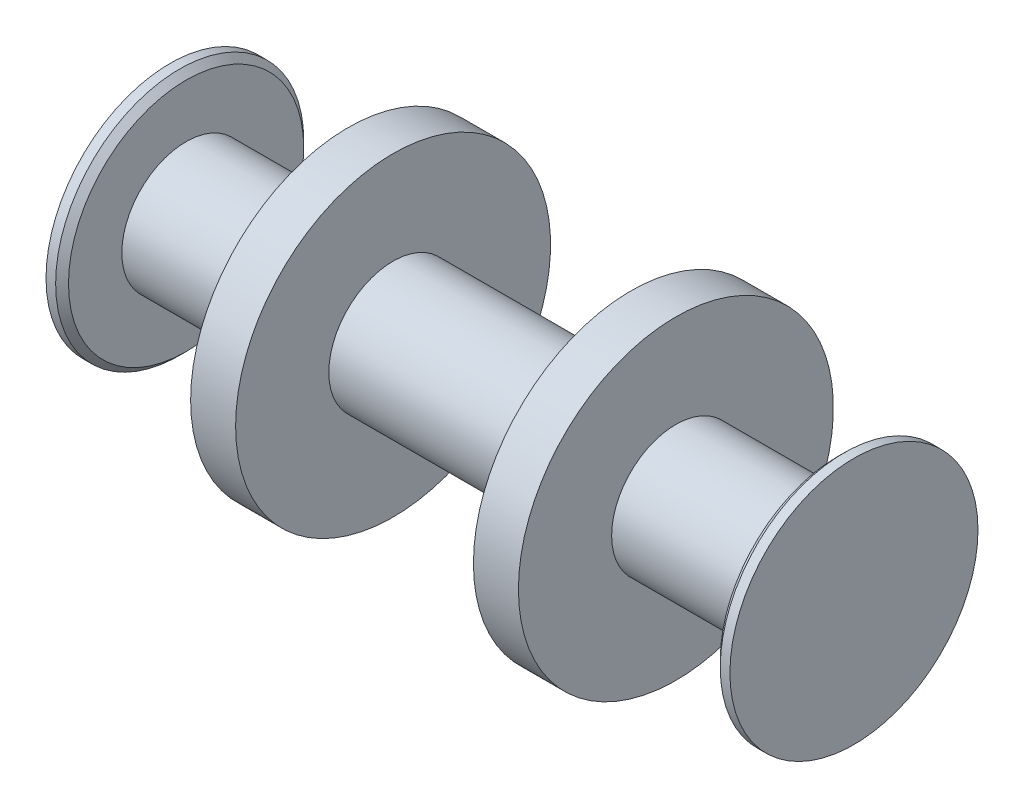
ISO-10303-21;
HEADER;
FILE_DESCRIPTION(('STEP AP214'),'2;1');
FILE_NAME('part.step','',(''),(''),'','','');
FILE_SCHEMA(('AUTOMOTIVE_DESIGN { 1 0 10303 214 1 1 1 1 }'));
ENDSEC;
DATA;
#1=APPLICATION_CONTEXT('core data for automotive mechanical design processes');
#2=APPLICATION_PROTOCOL_DEFINITION('international standard','automotive_design',2000,#1);
#3=PRODUCT_CONTEXT('',#1,'mechanical');
#4=PRODUCT('Part','Part','',(#3));
#5=PRODUCT_RELATED_PRODUCT_CATEGORY('part','',(#4));
#6=PRODUCT_DEFINITION_FORMATION('','',#4);
#7=PRODUCT_DEFINITION_CONTEXT('part definition',#1,'design');
#8=PRODUCT_DEFINITION('design','',#6,#7);
#9=PRODUCT_DEFINITION_SHAPE('','',#8);
#10=(LENGTH_UNIT() NAMED_UNIT(*) SI_UNIT(.MILLI.,.METRE.));
#11=(NAMED_UNIT(*) PLANE_ANGLE_UNIT() SI_UNIT($,.RADIAN.));
#12=(NAMED_UNIT(*) SI_UNIT($,.STERADIAN.) SOLID_ANGLE_UNIT());
#13=UNCERTAINTY_MEASURE_WITH_UNIT(LENGTH_MEASURE(1.E-05),#10,'distance_accuracy_value','');
#14=(GEOMETRIC_REPRESENTATION_CONTEXT(3) GLOBAL_UNCERTAINTY_ASSIGNED_CONTEXT((#13)) GLOBAL_UNIT_ASSIGNED_CONTEXT((#10,
#11,#12)) REPRESENTATION_CONTEXT('',''));
#15=CARTESIAN_POINT('',(0.,0.,0.));
#16=DIRECTION('',(0.,0.,1.));
#17=DIRECTION('',(1.,0.,0.));
#18=AXIS2_PLACEMENT_3D('',#15,#16,#17);
#19=CARTESIAN_POINT('',(-46.99,0.,0.));
#20=DIRECTION('',(1.,0.,0.));
#21=DIRECTION('',(0.,0.,-1.));
#22=AXIS2_PLACEMENT_3D('',#19,#20,#21);
#23=PLANE('',#22);
#24=CARTESIAN_POINT('',(-46.99,0.,0.));
#25=DIRECTION('',(-1.,0.,0.));
#26=DIRECTION('',(0.,0.,1.));
#27=AXIS2_PLACEMENT_3D('',#24,#25,#26);
#28=CIRCLE('',#27,25.4);
#29=CARTESIAN_POINT('',(-46.99,0.,25.4));
#30=VERTEX_POINT('',#29);
#31=EDGE_CURVE('E110',#30,#30,#28,.T.);
#32=ORIENTED_EDGE('',*,*,#31,.T.);
#33=EDGE_LOOP('',(#32));
#34=FACE_BOUND('',#33,.T.);
#35=CARTESIAN_POINT('',(-46.99,0.,0.));
#36=DIRECTION('',(-1.,0.,0.));
#37=DIRECTION('',(0.,0.,1.));
#38=AXIS2_PLACEMENT_3D('',#35,#36,#37);
#39=CIRCLE('',#38,62.23);
#40=CARTESIAN_POINT('',(-46.99,0.,62.23));
#41=VERTEX_POINT('',#40);
#42=EDGE_CURVE('E10',#41,#41,#39,.T.);
#43=ORIENTED_EDGE('',*,*,#42,.F.);
#44=EDGE_LOOP('',(#43));
#45=FACE_BOUND('',#44,.T.);
#46=ADVANCED_FACE('F43',(#34,#45),#23,.T.);
#47=CARTESIAN_POINT('',(-135.128,0.,0.));
#48=DIRECTION('',(-1.,0.,0.));
#49=DIRECTION('',(0.,0.,1.));
#50=AXIS2_PLACEMENT_3D('',#47,#48,#49);
#51=CYLINDRICAL_SURFACE('',#50,62.23);
#52=ORIENTED_EDGE('',*,*,#42,.T.);
#53=EDGE_LOOP('',(#52));
#54=FACE_BOUND('',#53,.T.);
#55=CARTESIAN_POINT('',(-64.77,0.,0.));
#56=DIRECTION('',(-1.,0.,0.));
#57=DIRECTION('',(0.,0.,1.));
#58=AXIS2_PLACEMENT_3D('',#55,#56,#57);
#59=CIRCLE('',#58,62.23);
#60=CARTESIAN_POINT('',(-64.77,0.,62.23));
#61=VERTEX_POINT('',#60);
#62=EDGE_CURVE('E50',#61,#61,#59,.T.);
#63=ORIENTED_EDGE('',*,*,#62,.F.);
#64=EDGE_LOOP('',(#63));
#65=FACE_BOUND('',#64,.T.);
#66=ADVANCED_FACE('F129',(#54,#65),#51,.T.);
#67=CARTESIAN_POINT('',(-64.77,0.,0.));
#68=DIRECTION('',(-1.,0.,0.));
#69=DIRECTION('',(0.,0.,1.));
#70=AXIS2_PLACEMENT_3D('',#67,#68,#69);
#71=PLANE('',#70);
#72=ORIENTED_EDGE('',*,*,#62,.T.);
#73=EDGE_LOOP('',(#72));
#74=FACE_BOUND('',#73,.T.);
#75=CARTESIAN_POINT('',(-64.77,0.,0.));
#76=DIRECTION('',(-1.,0.,0.));
#77=DIRECTION('',(0.,0.,1.));
#78=AXIS2_PLACEMENT_3D('',#75,#76,#77);
#79=CIRCLE('',#78,25.4);
#80=CARTESIAN_POINT('',(-64.77,0.,25.4));
#81=VERTEX_POINT('',#80);
#82=EDGE_CURVE('E55',#81,#81,#79,.T.);
#83=ORIENTED_EDGE('',*,*,#82,.F.);
#84=EDGE_LOOP('',(#83));
#85=FACE_BOUND('',#84,.T.);
#86=ADVANCED_FACE('F133',(#74,#85),#71,.T.);
#87=CARTESIAN_POINT('',(-135.128,0.,0.));
#88=DIRECTION('',(-1.,0.,0.));
#89=DIRECTION('',(0.,0.,1.));
#90=AXIS2_PLACEMENT_3D('',#87,#88,#89);
#91=CYLINDRICAL_SURFACE('',#90,25.4);
#92=ORIENTED_EDGE('',*,*,#82,.T.);
#93=EDGE_LOOP('',(#92));
#94=FACE_BOUND('',#93,.T.);
#95=CARTESIAN_POINT('',(-128.778,0.,0.));
#96=DIRECTION('',(-1.,0.,0.));
#97=DIRECTION('',(0.,0.,1.));
#98=AXIS2_PLACEMENT_3D('',#95,#96,#97);
#99=CIRCLE('',#98,25.4);
#100=CARTESIAN_POINT('',(-128.778,0.,25.4));
#101=VERTEX_POINT('',#100);
#102=EDGE_CURVE('E60',#101,#101,#99,.T.);
#103=ORIENTED_EDGE('',*,*,#102,.F.);
#104=EDGE_LOOP('',(#103));
#105=FACE_BOUND('',#104,.T.);
#106=ADVANCED_FACE('F137',(#94,#105),#91,.T.);
#107=CARTESIAN_POINT('',(-128.778,0.,0.));
#108=DIRECTION('',(1.,0.,0.));
#109=DIRECTION('',(0.,0.,-1.));
#110=AXIS2_PLACEMENT_3D('',#107,#108,#109);
#111=PLANE('',#110);
#112=ORIENTED_EDGE('',*,*,#102,.T.);
#113=EDGE_LOOP('',(#112));
#114=FACE_BOUND('',#113,.T.);
#115=CARTESIAN_POINT('',(-128.778,0.,0.));
#116=DIRECTION('',(-1.,0.,0.));
#117=DIRECTION('',(0.,0.,1.));
#118=AXIS2_PLACEMENT_3D('',#115,#116,#117);
#119=CIRCLE('',#118,46.482);
#120=CARTESIAN_POINT('',(-128.778,0.,46.482));
#121=VERTEX_POINT('',#120);
#122=EDGE_CURVE('E66',#121,#121,#119,.T.);
#123=ORIENTED_EDGE('',*,*,#122,.F.);
#124=EDGE_LOOP('',(#123));
#125=FACE_BOUND('',#124,.T.);
#126=ADVANCED_FACE('F143',(#114,#125),#111,.T.);
#127=CARTESIAN_POINT('',(-131.318,0.,0.));
#128=DIRECTION('',(-1.,0.,0.));
#129=DIRECTION('',(0.,0.,1.));
#130=AXIS2_PLACEMENT_3D('',#127,#128,#129);
#131=CONICAL_SURFACE('',#130,49.022,0.785398163397451);
#132=ORIENTED_EDGE('',*,*,#122,.T.);
#133=EDGE_LOOP('',(#132));
#134=FACE_BOUND('',#133,.T.);
#135=CARTESIAN_POINT('',(-131.318,0.,0.));
#136=DIRECTION('',(-1.,0.,0.));
#137=DIRECTION('',(0.,0.,1.));
#138=AXIS2_PLACEMENT_3D('',#135,#136,#137);
#139=CIRCLE('',#138,49.022);
#140=CARTESIAN_POINT('',(-131.318,0.,49.022));
#141=VERTEX_POINT('',#140);
#142=EDGE_CURVE('E70',#141,#141,#139,.T.);
#143=ORIENTED_EDGE('',*,*,#142,.F.);
#144=EDGE_LOOP('',(#143));
#145=FACE_BOUND('',#144,.T.);
#146=ADVANCED_FACE('F147',(#134,#145),#131,.T.);
#147=CARTESIAN_POINT('',(-135.128,0.,0.));
#148=DIRECTION('',(-1.,0.,0.));
#149=DIRECTION('',(0.,0.,1.));
#150=AXIS2_PLACEMENT_3D('',#147,#148,#149);
#151=CYLINDRICAL_SURFACE('',#150,49.022);
#152=ORIENTED_EDGE('',*,*,#142,.T.);
#153=EDGE_LOOP('',(#152));
#154=FACE_BOUND('',#153,.T.);
#155=CARTESIAN_POINT('',(-135.128,0.,0.));
#156=DIRECTION('',(-1.,0.,0.));
#157=DIRECTION('',(0.,0.,1.));
#158=AXIS2_PLACEMENT_3D('',#155,#156,#157);
#159=CIRCLE('',#158,49.022);
#160=CARTESIAN_POINT('',(-135.128,0.,49.022));
#161=VERTEX_POINT('',#160);
#162=EDGE_CURVE('E74',#161,#161,#159,.T.);
#163=ORIENTED_EDGE('',*,*,#162,.F.);
#164=EDGE_LOOP('',(#163));
#165=FACE_BOUND('',#164,.T.);
#166=ADVANCED_FACE('F151',(#154,#165),#151,.T.);
#167=CARTESIAN_POINT('',(-135.128,0.,0.));
#168=DIRECTION('',(-1.,0.,0.));
#169=DIRECTION('',(0.,0.,1.));
#170=AXIS2_PLACEMENT_3D('',#167,#168,#169);
#171=PLANE('',#170);
#172=ORIENTED_EDGE('',*,*,#162,.T.);
#173=EDGE_LOOP('',(#172));
#174=FACE_BOUND('',#173,.T.);
#175=ADVANCED_FACE('F155',(#174),#171,.T.);
#176=CARTESIAN_POINT('',(135.128,0.,0.));
#177=DIRECTION('',(-1.,0.,0.));
#178=DIRECTION('',(0.,0.,1.));
#179=AXIS2_PLACEMENT_3D('',#176,#177,#178);
#180=PLANE('',#179);
#181=CARTESIAN_POINT('',(135.128,0.,0.));
#182=DIRECTION('',(-1.,0.,0.));
#183=DIRECTION('',(0.,0.,1.));
#184=AXIS2_PLACEMENT_3D('',#181,#182,#183);
#185=CIRCLE('',#184,49.022);
#186=CARTESIAN_POINT('',(135.128,0.,49.022));
#187=VERTEX_POINT('',#186);
#188=EDGE_CURVE('E78',#187,#187,#185,.T.);
#189=ORIENTED_EDGE('',*,*,#188,.F.);
#190=EDGE_LOOP('',(#189));
#191=FACE_BOUND('',#190,.T.);
#192=ADVANCED_FACE('F159',(#191),#180,.F.);
#193=CARTESIAN_POINT('',(-135.128,0.,0.));
#194=DIRECTION('',(-1.,0.,0.));
#195=DIRECTION('',(0.,0.,1.));
#196=AXIS2_PLACEMENT_3D('',#193,#194,#195);
#197=CYLINDRICAL_SURFACE('',#196,49.022);
#198=CARTESIAN_POINT('',(131.318,0.,0.));
#199=DIRECTION('',(-1.,0.,0.));
#200=DIRECTION('',(0.,0.,1.));
#201=AXIS2_PLACEMENT_3D('',#198,#199,#200);
#202=CIRCLE('',#201,49.022);
#203=CARTESIAN_POINT('',(131.318,0.,49.022));
#204=VERTEX_POINT('',#203);
#205=EDGE_CURVE('E82',#204,#204,#202,.T.);
#206=ORIENTED_EDGE('',*,*,#205,.F.);
#207=EDGE_LOOP('',(#206));
#208=FACE_BOUND('',#207,.T.);
#209=ORIENTED_EDGE('',*,*,#188,.T.);
#210=EDGE_LOOP('',(#209));
#211=FACE_BOUND('',#210,.T.);
#212=ADVANCED_FACE('F163',(#208,#211),#197,.T.);
#213=CARTESIAN_POINT('',(131.318,0.,0.));
#214=DIRECTION('',(1.,0.,0.));
#215=DIRECTION('',(0.,0.,-1.));
#216=AXIS2_PLACEMENT_3D('',#213,#214,#215);
#217=CONICAL_SURFACE('',#216,49.022,0.785398163397451);
#218=CARTESIAN_POINT('',(128.778,0.,0.));
#219=DIRECTION('',(-1.,0.,0.));
#220=DIRECTION('',(0.,0.,1.));
#221=AXIS2_PLACEMENT_3D('',#218,#219,#220);
#222=CIRCLE('',#221,46.482);
#223=CARTESIAN_POINT('',(128.778,0.,46.482));
#224=VERTEX_POINT('',#223);
#225=EDGE_CURVE('E86',#224,#224,#222,.T.);
#226=ORIENTED_EDGE('',*,*,#225,.F.);
#227=EDGE_LOOP('',(#226));
#228=FACE_BOUND('',#227,.T.);
#229=ORIENTED_EDGE('',*,*,#205,.T.);
#230=EDGE_LOOP('',(#229));
#231=FACE_BOUND('',#230,.T.);
#232=ADVANCED_FACE('F167',(#228,#231),#217,.T.);
#233=CARTESIAN_POINT('',(128.778,0.,0.));
#234=DIRECTION('',(1.,0.,0.));
#235=DIRECTION('',(0.,0.,-1.));
#236=AXIS2_PLACEMENT_3D('',#233,#234,#235);
#237=PLANE('',#236);
#238=CARTESIAN_POINT('',(128.778,0.,0.));
#239=DIRECTION('',(-1.,0.,0.));
#240=DIRECTION('',(0.,0.,1.));
#241=AXIS2_PLACEMENT_3D('',#238,#239,#240);
#242=CIRCLE('',#241,25.4);
#243=CARTESIAN_POINT('',(128.778,0.,25.4));
#244=VERTEX_POINT('',#243);
#245=EDGE_CURVE('E90',#244,#244,#242,.T.);
#246=ORIENTED_EDGE('',*,*,#245,.F.);
#247=EDGE_LOOP('',(#246));
#248=FACE_BOUND('',#247,.T.);
#249=ORIENTED_EDGE('',*,*,#225,.T.);
#250=EDGE_LOOP('',(#249));
#251=FACE_BOUND('',#250,.T.);
#252=ADVANCED_FACE('F171',(#248,#251),#237,.F.);
#253=CARTESIAN_POINT('',(-135.128,0.,0.));
#254=DIRECTION('',(-1.,0.,0.));
#255=DIRECTION('',(0.,0.,1.));
#256=AXIS2_PLACEMENT_3D('',#253,#254,#255);
#257=CYLINDRICAL_SURFACE('',#256,25.4);
#258=CARTESIAN_POINT('',(64.77,0.,0.));
#259=DIRECTION('',(-1.,0.,0.));
#260=DIRECTION('',(0.,0.,1.));
#261=AXIS2_PLACEMENT_3D('',#258,#259,#260);
#262=CIRCLE('',#261,25.4);
#263=CARTESIAN_POINT('',(64.77,0.,25.4));
#264=VERTEX_POINT('',#263);
#265=EDGE_CURVE('E94',#264,#264,#262,.T.);
#266=ORIENTED_EDGE('',*,*,#265,.F.);
#267=EDGE_LOOP('',(#266));
#268=FACE_BOUND('',#267,.T.);
#269=ORIENTED_EDGE('',*,*,#245,.T.);
#270=EDGE_LOOP('',(#269));
#271=FACE_BOUND('',#270,.T.);
#272=ADVANCED_FACE('F175',(#268,#271),#257,.T.);
#273=CARTESIAN_POINT('',(64.77,0.,0.));
#274=DIRECTION('',(-1.,0.,0.));
#275=DIRECTION('',(0.,0.,1.));
#276=AXIS2_PLACEMENT_3D('',#273,#274,#275);
#277=PLANE('',#276);
#278=CARTESIAN_POINT('',(64.77,0.,0.));
#279=DIRECTION('',(-1.,0.,0.));
#280=DIRECTION('',(0.,0.,1.));
#281=AXIS2_PLACEMENT_3D('',#278,#279,#280);
#282=CIRCLE('',#281,62.23);
#283=CARTESIAN_POINT('',(64.77,0.,62.23));
#284=VERTEX_POINT('',#283);
#285=EDGE_CURVE('E98',#284,#284,#282,.T.);
#286=ORIENTED_EDGE('',*,*,#285,.F.);
#287=EDGE_LOOP('',(#286));
#288=FACE_BOUND('',#287,.T.);
#289=ORIENTED_EDGE('',*,*,#265,.T.);
#290=EDGE_LOOP('',(#289));
#291=FACE_BOUND('',#290,.T.);
#292=ADVANCED_FACE('F179',(#288,#291),#277,.F.);
#293=CARTESIAN_POINT('',(-135.128,0.,0.));
#294=DIRECTION('',(-1.,0.,0.));
#295=DIRECTION('',(0.,0.,1.));
#296=AXIS2_PLACEMENT_3D('',#293,#294,#295);
#297=CYLINDRICAL_SURFACE('',#296,62.23);
#298=CARTESIAN_POINT('',(46.99,0.,0.));
#299=DIRECTION('',(-1.,0.,0.));
#300=DIRECTION('',(0.,0.,1.));
#301=AXIS2_PLACEMENT_3D('',#298,#299,#300);
#302=CIRCLE('',#301,62.23);
#303=CARTESIAN_POINT('',(46.99,0.,62.23));
#304=VERTEX_POINT('',#303);
#305=EDGE_CURVE('E102',#304,#304,#302,.T.);
#306=ORIENTED_EDGE('',*,*,#305,.F.);
#307=EDGE_LOOP('',(#306));
#308=FACE_BOUND('',#307,.T.);
#309=ORIENTED_EDGE('',*,*,#285,.T.);
#310=EDGE_LOOP('',(#309));
#311=FACE_BOUND('',#310,.T.);
#312=ADVANCED_FACE('F125',(#308,#311),#297,.T.);
#313=CARTESIAN_POINT('',(46.99,0.,0.));
#314=DIRECTION('',(1.,0.,0.));
#315=DIRECTION('',(0.,0.,-1.));
#316=AXIS2_PLACEMENT_3D('',#313,#314,#315);
#317=PLANE('',#316);
#318=CARTESIAN_POINT('',(46.99,0.,0.));
#319=DIRECTION('',(-1.,0.,0.));
#320=DIRECTION('',(0.,0.,1.));
#321=AXIS2_PLACEMENT_3D('',#318,#319,#320);
#322=CIRCLE('',#321,25.4);
#323=CARTESIAN_POINT('',(46.99,0.,25.4));
#324=VERTEX_POINT('',#323);
#325=EDGE_CURVE('E106',#324,#324,#322,.T.);
#326=ORIENTED_EDGE('',*,*,#325,.F.);
#327=EDGE_LOOP('',(#326));
#328=FACE_BOUND('',#327,.T.);
#329=ORIENTED_EDGE('',*,*,#305,.T.);
#330=EDGE_LOOP('',(#329));
#331=FACE_BOUND('',#330,.T.);
#332=ADVANCED_FACE('F119',(#328,#331),#317,.F.);
#333=CARTESIAN_POINT('',(-135.128,0.,0.));
#334=DIRECTION('',(-1.,0.,0.));
#335=DIRECTION('',(0.,0.,1.));
#336=AXIS2_PLACEMENT_3D('',#333,#334,#335);
#337=CYLINDRICAL_SURFACE('',#336,25.4);
#338=ORIENTED_EDGE('',*,*,#325,.T.);
#339=EDGE_LOOP('',(#338));
#340=FACE_BOUND('',#339,.T.);
#341=ORIENTED_EDGE('',*,*,#31,.F.);
#342=EDGE_LOOP('',(#341));
#343=FACE_BOUND('',#342,.T.);
#344=ADVANCED_FACE('F117',(#340,#343),#337,.T.);
#345=CLOSED_SHELL('',(#46,#66,#86,#106,#126,#146,#166,#175,#192,#212,#232,#252,#272,#292,#312,
#332,#344));
#346=MANIFOLD_SOLID_BREP('B2',#345);
#347=ADVANCED_BREP_SHAPE_REPRESENTATION('',(#18,#346),#14);
#348=SHAPE_DEFINITION_REPRESENTATION(#9,#347);
ENDSEC;
END-ISO-10303-21;
